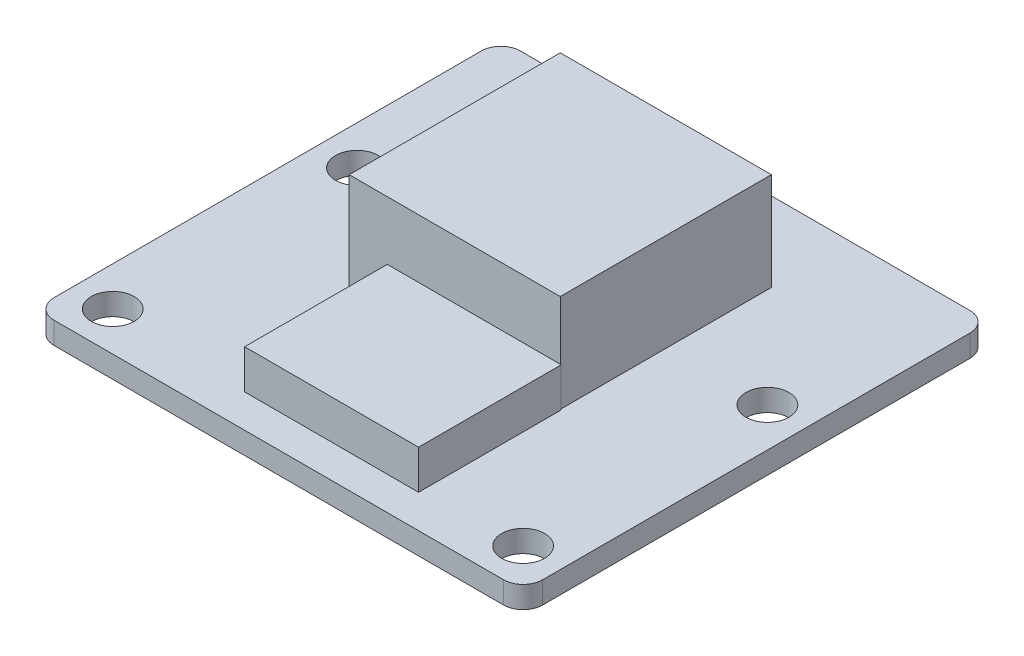
ISO-10303-21;
HEADER;
FILE_DESCRIPTION(('STEP AP214'),'2;1');
FILE_NAME('part.step','',(''),(''),'','','');
FILE_SCHEMA(('AUTOMOTIVE_DESIGN { 1 0 10303 214 1 1 1 1 }'));
ENDSEC;
DATA;
#1=APPLICATION_CONTEXT('core data for automotive mechanical design processes');
#2=APPLICATION_PROTOCOL_DEFINITION('international standard','automotive_design',2000,#1);
#3=PRODUCT_CONTEXT('',#1,'mechanical');
#4=PRODUCT('Part','Part','',(#3));
#5=PRODUCT_RELATED_PRODUCT_CATEGORY('part','',(#4));
#6=PRODUCT_DEFINITION_FORMATION('','',#4);
#7=PRODUCT_DEFINITION_CONTEXT('part definition',#1,'design');
#8=PRODUCT_DEFINITION('design','',#6,#7);
#9=PRODUCT_DEFINITION_SHAPE('','',#8);
#10=(LENGTH_UNIT() NAMED_UNIT(*) SI_UNIT(.MILLI.,.METRE.));
#11=(NAMED_UNIT(*) PLANE_ANGLE_UNIT() SI_UNIT($,.RADIAN.));
#12=(NAMED_UNIT(*) SI_UNIT($,.STERADIAN.) SOLID_ANGLE_UNIT());
#13=UNCERTAINTY_MEASURE_WITH_UNIT(LENGTH_MEASURE(1.E-05),#10,'distance_accuracy_value','');
#14=(GEOMETRIC_REPRESENTATION_CONTEXT(3) GLOBAL_UNCERTAINTY_ASSIGNED_CONTEXT((#13)) GLOBAL_UNIT_ASSIGNED_CONTEXT((#10,
#11,#12)) REPRESENTATION_CONTEXT('',''));
#15=CARTESIAN_POINT('',(0.,0.,0.));
#16=DIRECTION('',(0.,0.,1.));
#17=DIRECTION('',(1.,0.,0.));
#18=AXIS2_PLACEMENT_3D('',#15,#16,#17);
#19=CARTESIAN_POINT('',(0.,1.12,0.));
#20=DIRECTION('',(0.,-1.,0.));
#21=DIRECTION('',(0.,0.,-1.));
#22=AXIS2_PLACEMENT_3D('',#19,#20,#21);
#23=PLANE('',#22);
#24=CARTESIAN_POINT('',(10.5,1.12,-2.569));
#25=DIRECTION('',(0.,1.,0.));
#26=DIRECTION('',(0.,0.,1.));
#27=AXIS2_PLACEMENT_3D('',#24,#25,#26);
#28=CIRCLE('',#27,1.1);
#29=CARTESIAN_POINT('',(10.5,1.12,-1.469));
#30=VERTEX_POINT('',#29);
#31=EDGE_CURVE('E243',#30,#30,#28,.T.);
#32=ORIENTED_EDGE('',*,*,#31,.F.);
#33=EDGE_LOOP('',(#32));
#34=FACE_BOUND('',#33,.T.);
#35=CARTESIAN_POINT('',(-10.5,1.12,9.931));
#36=DIRECTION('',(0.,1.,0.));
#37=DIRECTION('',(0.,0.,1.));
#38=AXIS2_PLACEMENT_3D('',#35,#36,#37);
#39=CIRCLE('',#38,1.1);
#40=CARTESIAN_POINT('',(-10.5,1.12,11.031));
#41=VERTEX_POINT('',#40);
#42=EDGE_CURVE('E242',#41,#41,#39,.T.);
#43=ORIENTED_EDGE('',*,*,#42,.F.);
#44=EDGE_LOOP('',(#43));
#45=FACE_BOUND('',#44,.T.);
#46=CARTESIAN_POINT('',(10.5,1.12,9.931));
#47=DIRECTION('',(0.,1.,0.));
#48=DIRECTION('',(0.,0.,1.));
#49=AXIS2_PLACEMENT_3D('',#46,#47,#48);
#50=CIRCLE('',#49,1.1);
#51=CARTESIAN_POINT('',(10.5,1.12,11.031));
#52=VERTEX_POINT('',#51);
#53=EDGE_CURVE('E238',#52,#52,#50,.T.);
#54=ORIENTED_EDGE('',*,*,#53,.F.);
#55=EDGE_LOOP('',(#54));
#56=FACE_BOUND('',#55,.T.);
#57=CARTESIAN_POINT('',(-10.5,1.12,-2.569));
#58=DIRECTION('',(0.,1.,0.));
#59=DIRECTION('',(0.,0.,1.));
#60=AXIS2_PLACEMENT_3D('',#57,#58,#59);
#61=CIRCLE('',#60,1.1);
#62=CARTESIAN_POINT('',(-10.5,1.12,-1.469));
#63=VERTEX_POINT('',#62);
#64=EDGE_CURVE('E247',#63,#63,#61,.T.);
#65=ORIENTED_EDGE('',*,*,#64,.F.);
#66=EDGE_LOOP('',(#65));
#67=FACE_BOUND('',#66,.T.);
#68=DIRECTION('',(-1.,0.,0.));
#69=VECTOR('',#68,1.);
#70=CARTESIAN_POINT('',(12.5,1.12,-11.931));
#71=LINE('',#70,#69);
#72=CARTESIAN_POINT('',(11.5,1.12,-11.931));
#73=VERTEX_POINT('',#72);
#74=CARTESIAN_POINT('',(-11.5,1.12,-11.931));
#75=VERTEX_POINT('',#74);
#76=EDGE_CURVE('E268',#73,#75,#71,.T.);
#77=ORIENTED_EDGE('',*,*,#76,.T.);
#78=CARTESIAN_POINT('',(-11.5,1.12,-10.931));
#79=DIRECTION('',(0.,-1.,0.));
#80=DIRECTION('',(0.,0.,-1.));
#81=AXIS2_PLACEMENT_3D('',#78,#79,#80);
#82=CIRCLE('',#81,1.);
#83=CARTESIAN_POINT('',(-12.5,1.12,-10.931));
#84=VERTEX_POINT('',#83);
#85=EDGE_CURVE('E323',#75,#84,#82,.F.);
#86=ORIENTED_EDGE('',*,*,#85,.T.);
#87=DIRECTION('',(0.,0.,1.));
#88=VECTOR('',#87,1.);
#89=CARTESIAN_POINT('',(-12.5,1.12,-11.931));
#90=LINE('',#89,#88);
#91=CARTESIAN_POINT('',(-12.5,1.12,10.931));
#92=VERTEX_POINT('',#91);
#93=EDGE_CURVE('E255',#84,#92,#90,.T.);
#94=ORIENTED_EDGE('',*,*,#93,.T.);
#95=CARTESIAN_POINT('',(-11.5,1.12,10.931));
#96=DIRECTION('',(0.,-1.,0.));
#97=DIRECTION('',(0.,0.,-1.));
#98=AXIS2_PLACEMENT_3D('',#95,#96,#97);
#99=CIRCLE('',#98,1.);
#100=CARTESIAN_POINT('',(-11.5,1.12,11.931));
#101=VERTEX_POINT('',#100);
#102=EDGE_CURVE('E314',#92,#101,#99,.F.);
#103=ORIENTED_EDGE('',*,*,#102,.T.);
#104=DIRECTION('',(1.,0.,0.));
#105=VECTOR('',#104,1.);
#106=CARTESIAN_POINT('',(12.5,1.12,11.931));
#107=LINE('',#106,#105);
#108=CARTESIAN_POINT('',(11.5,1.12,11.931));
#109=VERTEX_POINT('',#108);
#110=EDGE_CURVE('E259',#101,#109,#107,.T.);
#111=ORIENTED_EDGE('',*,*,#110,.T.);
#112=CARTESIAN_POINT('',(11.5,1.12,10.931));
#113=DIRECTION('',(0.,-1.,0.));
#114=DIRECTION('',(0.,0.,-1.));
#115=AXIS2_PLACEMENT_3D('',#112,#113,#114);
#116=CIRCLE('',#115,1.);
#117=CARTESIAN_POINT('',(12.5,1.12,10.931));
#118=VERTEX_POINT('',#117);
#119=EDGE_CURVE('E317',#109,#118,#116,.F.);
#120=ORIENTED_EDGE('',*,*,#119,.T.);
#121=DIRECTION('',(0.,0.,-1.));
#122=VECTOR('',#121,1.);
#123=CARTESIAN_POINT('',(12.5,1.12,-11.931));
#124=LINE('',#123,#122);
#125=CARTESIAN_POINT('',(12.5,1.12,-10.931));
#126=VERTEX_POINT('',#125);
#127=EDGE_CURVE('E264',#118,#126,#124,.T.);
#128=ORIENTED_EDGE('',*,*,#127,.T.);
#129=CARTESIAN_POINT('',(11.5,1.12,-10.931));
#130=DIRECTION('',(0.,-1.,0.));
#131=DIRECTION('',(0.,0.,-1.));
#132=AXIS2_PLACEMENT_3D('',#129,#130,#131);
#133=CIRCLE('',#132,1.);
#134=EDGE_CURVE('E320',#126,#73,#133,.F.);
#135=ORIENTED_EDGE('',*,*,#134,.T.);
#136=EDGE_LOOP('',(#77,#86,#94,#103,#111,#120,#128,#135));
#137=FACE_BOUND('',#136,.T.);
#138=DIRECTION('',(-1.,0.,0.));
#139=VECTOR('',#138,1.);
#140=CARTESIAN_POINT('',(-3.45,1.12,2.931));
#141=LINE('',#140,#139);
#142=CARTESIAN_POINT('',(5.45,1.12,2.931));
#143=VERTEX_POINT('',#142);
#144=CARTESIAN_POINT('',(5.4,1.12,2.931));
#145=VERTEX_POINT('',#144);
#146=EDGE_CURVE('E61',#143,#145,#141,.T.);
#147=ORIENTED_EDGE('',*,*,#146,.F.);
#148=DIRECTION('',(0.,0.,-1.));
#149=VECTOR('',#148,1.);
#150=CARTESIAN_POINT('',(5.45,1.12,10.231));
#151=LINE('',#150,#149);
#152=CARTESIAN_POINT('',(5.45,1.12,10.231));
#153=VERTEX_POINT('',#152);
#154=EDGE_CURVE('E66',#153,#143,#151,.T.);
#155=ORIENTED_EDGE('',*,*,#154,.F.);
#156=DIRECTION('',(1.,0.,0.));
#157=VECTOR('',#156,1.);
#158=CARTESIAN_POINT('',(-3.45,1.12,10.231));
#159=LINE('',#158,#157);
#160=CARTESIAN_POINT('',(-3.45,1.12,10.231));
#161=VERTEX_POINT('',#160);
#162=EDGE_CURVE('E181',#161,#153,#159,.T.);
#163=ORIENTED_EDGE('',*,*,#162,.F.);
#164=DIRECTION('',(0.,0.,1.));
#165=VECTOR('',#164,1.);
#166=CARTESIAN_POINT('',(-3.45,1.12,10.231));
#167=LINE('',#166,#165);
#168=CARTESIAN_POINT('',(-3.45,1.12,2.931));
#169=VERTEX_POINT('',#168);
#170=EDGE_CURVE('E714',#169,#161,#167,.T.);
#171=ORIENTED_EDGE('',*,*,#170,.F.);
#172=DIRECTION('',(1.,0.,0.));
#173=VECTOR('',#172,1.);
#174=CARTESIAN_POINT('',(-5.4,1.12,2.931));
#175=LINE('',#174,#173);
#176=CARTESIAN_POINT('',(-5.4,1.12,2.931));
#177=VERTEX_POINT('',#176);
#178=EDGE_CURVE('E203',#177,#169,#175,.T.);
#179=ORIENTED_EDGE('',*,*,#178,.F.);
#180=DIRECTION('',(0.,0.,1.));
#181=VECTOR('',#180,1.);
#182=CARTESIAN_POINT('',(-5.4,1.12,2.931));
#183=LINE('',#182,#181);
#184=CARTESIAN_POINT('',(-5.4,1.12,-7.869));
#185=VERTEX_POINT('',#184);
#186=EDGE_CURVE('E215',#185,#177,#183,.T.);
#187=ORIENTED_EDGE('',*,*,#186,.F.);
#188=DIRECTION('',(-1.,0.,0.));
#189=VECTOR('',#188,1.);
#190=CARTESIAN_POINT('',(-5.4,1.12,-7.869));
#191=LINE('',#190,#189);
#192=CARTESIAN_POINT('',(5.4,1.12,-7.869));
#193=VERTEX_POINT('',#192);
#194=EDGE_CURVE('E191',#193,#185,#191,.T.);
#195=ORIENTED_EDGE('',*,*,#194,.F.);
#196=DIRECTION('',(0.,0.,-1.));
#197=VECTOR('',#196,1.);
#198=CARTESIAN_POINT('',(5.4,1.12,2.931));
#199=LINE('',#198,#197);
#200=EDGE_CURVE('E185',#145,#193,#199,.T.);
#201=ORIENTED_EDGE('',*,*,#200,.F.);
#202=EDGE_LOOP('',(#147,#155,#163,#171,#179,#187,#195,#201));
#203=FACE_BOUND('',#202,.T.);
#204=ADVANCED_FACE('F45',(#34,#45,#56,#67,#137,#203),#23,.F.);
#205=CARTESIAN_POINT('',(-5.4,6.12,2.931));
#206=DIRECTION('',(0.,0.,-1.));
#207=DIRECTION('',(-1.,0.,0.));
#208=AXIS2_PLACEMENT_3D('',#205,#206,#207);
#209=PLANE('',#208);
#210=DIRECTION('',(0.,-1.,0.));
#211=VECTOR('',#210,1.);
#212=CARTESIAN_POINT('',(-3.45,3.12,2.931));
#213=LINE('',#212,#211);
#214=CARTESIAN_POINT('',(-3.45,3.12,2.931));
#215=VERTEX_POINT('',#214);
#216=EDGE_CURVE('E186',#215,#169,#213,.T.);
#217=ORIENTED_EDGE('',*,*,#216,.F.);
#218=DIRECTION('',(-1.,0.,0.));
#219=VECTOR('',#218,1.);
#220=CARTESIAN_POINT('',(-5.4,3.12,2.931));
#221=LINE('',#220,#219);
#222=CARTESIAN_POINT('',(5.4,3.12,2.931));
#223=VERTEX_POINT('',#222);
#224=EDGE_CURVE('E11',#223,#215,#221,.T.);
#225=ORIENTED_EDGE('',*,*,#224,.F.);
#226=DIRECTION('',(0.,-1.,0.));
#227=VECTOR('',#226,1.);
#228=CARTESIAN_POINT('',(5.4,6.12,2.931));
#229=LINE('',#228,#227);
#230=CARTESIAN_POINT('',(5.4,6.12,2.931));
#231=VERTEX_POINT('',#230);
#232=EDGE_CURVE('E222',#231,#223,#229,.T.);
#233=ORIENTED_EDGE('',*,*,#232,.F.);
#234=DIRECTION('',(1.,0.,0.));
#235=VECTOR('',#234,1.);
#236=CARTESIAN_POINT('',(-5.4,6.12,2.931));
#237=LINE('',#236,#235);
#238=CARTESIAN_POINT('',(-5.4,6.12,2.931));
#239=VERTEX_POINT('',#238);
#240=EDGE_CURVE('E209',#239,#231,#237,.T.);
#241=ORIENTED_EDGE('',*,*,#240,.F.);
#242=DIRECTION('',(0.,-1.,0.));
#243=VECTOR('',#242,1.);
#244=CARTESIAN_POINT('',(-5.4,6.12,2.931));
#245=LINE('',#244,#243);
#246=EDGE_CURVE('E226',#239,#177,#245,.T.);
#247=ORIENTED_EDGE('',*,*,#246,.T.);
#248=ORIENTED_EDGE('',*,*,#178,.T.);
#249=EDGE_LOOP('',(#217,#225,#233,#241,#247,#248));
#250=FACE_BOUND('',#249,.T.);
#251=ADVANCED_FACE('F410',(#250),#209,.F.);
#252=CARTESIAN_POINT('',(-12.5,1.12,-11.931));
#253=DIRECTION('',(1.,0.,0.));
#254=DIRECTION('',(0.,0.,-1.));
#255=AXIS2_PLACEMENT_3D('',#252,#253,#254);
#256=PLANE('',#255);
#257=ORIENTED_EDGE('',*,*,#93,.F.);
#258=DIRECTION('',(0.,-1.,0.));
#259=VECTOR('',#258,1.);
#260=CARTESIAN_POINT('',(-12.5,1.12,-10.931));
#261=LINE('',#260,#259);
#262=CARTESIAN_POINT('',(-12.5,0.,-10.931));
#263=VERTEX_POINT('',#262);
#264=EDGE_CURVE('E291',#84,#263,#261,.T.);
#265=ORIENTED_EDGE('',*,*,#264,.T.);
#266=DIRECTION('',(0.,0.,1.));
#267=VECTOR('',#266,1.);
#268=CARTESIAN_POINT('',(-12.5,0.,-11.931));
#269=LINE('',#268,#267);
#270=CARTESIAN_POINT('',(-12.5,0.,10.931));
#271=VERTEX_POINT('',#270);
#272=EDGE_CURVE('E273',#263,#271,#269,.T.);
#273=ORIENTED_EDGE('',*,*,#272,.T.);
#274=DIRECTION('',(0.,-1.,0.));
#275=VECTOR('',#274,1.);
#276=CARTESIAN_POINT('',(-12.5,1.12,10.931));
#277=LINE('',#276,#275);
#278=EDGE_CURVE('E272',#271,#92,#277,.F.);
#279=ORIENTED_EDGE('',*,*,#278,.T.);
#280=EDGE_LOOP('',(#257,#265,#273,#279));
#281=FACE_BOUND('',#280,.T.);
#282=ADVANCED_FACE('F374',(#281),#256,.F.);
#283=CARTESIAN_POINT('',(12.5,1.12,11.931));
#284=DIRECTION('',(0.,0.,-1.));
#285=DIRECTION('',(-1.,0.,0.));
#286=AXIS2_PLACEMENT_3D('',#283,#284,#285);
#287=PLANE('',#286);
#288=DIRECTION('',(1.,0.,0.));
#289=VECTOR('',#288,1.);
#290=CARTESIAN_POINT('',(12.5,0.,11.931));
#291=LINE('',#290,#289);
#292=CARTESIAN_POINT('',(-11.5,0.,11.931));
#293=VERTEX_POINT('',#292);
#294=CARTESIAN_POINT('',(11.5,0.,11.931));
#295=VERTEX_POINT('',#294);
#296=EDGE_CURVE('E277',#293,#295,#291,.T.);
#297=ORIENTED_EDGE('',*,*,#296,.T.);
#298=DIRECTION('',(0.,-1.,0.));
#299=VECTOR('',#298,1.);
#300=CARTESIAN_POINT('',(11.5,1.12,11.931));
#301=LINE('',#300,#299);
#302=EDGE_CURVE('E54',#295,#109,#301,.F.);
#303=ORIENTED_EDGE('',*,*,#302,.T.);
#304=ORIENTED_EDGE('',*,*,#110,.F.);
#305=DIRECTION('',(0.,-1.,0.));
#306=VECTOR('',#305,1.);
#307=CARTESIAN_POINT('',(-11.5,1.12,11.931));
#308=LINE('',#307,#306);
#309=EDGE_CURVE('E333',#101,#293,#308,.T.);
#310=ORIENTED_EDGE('',*,*,#309,.T.);
#311=EDGE_LOOP('',(#297,#303,#304,#310));
#312=FACE_BOUND('',#311,.T.);
#313=ADVANCED_FACE('F383',(#312),#287,.F.);
#314=CARTESIAN_POINT('',(12.5,1.12,-11.931));
#315=DIRECTION('',(-1.,0.,0.));
#316=DIRECTION('',(0.,0.,1.));
#317=AXIS2_PLACEMENT_3D('',#314,#315,#316);
#318=PLANE('',#317);
#319=DIRECTION('',(0.,0.,-1.));
#320=VECTOR('',#319,1.);
#321=CARTESIAN_POINT('',(12.5,0.,-11.931));
#322=LINE('',#321,#320);
#323=CARTESIAN_POINT('',(12.5,0.,10.931));
#324=VERTEX_POINT('',#323);
#325=CARTESIAN_POINT('',(12.5,0.,-10.931));
#326=VERTEX_POINT('',#325);
#327=EDGE_CURVE('E282',#324,#326,#322,.T.);
#328=ORIENTED_EDGE('',*,*,#327,.T.);
#329=DIRECTION('',(0.,-1.,0.));
#330=VECTOR('',#329,1.);
#331=CARTESIAN_POINT('',(12.5,1.12,-10.931));
#332=LINE('',#331,#330);
#333=EDGE_CURVE('E330',#326,#126,#332,.F.);
#334=ORIENTED_EDGE('',*,*,#333,.T.);
#335=ORIENTED_EDGE('',*,*,#127,.F.);
#336=DIRECTION('',(0.,-1.,0.));
#337=VECTOR('',#336,1.);
#338=CARTESIAN_POINT('',(12.5,1.12,10.931));
#339=LINE('',#338,#337);
#340=EDGE_CURVE('E326',#118,#324,#339,.T.);
#341=ORIENTED_EDGE('',*,*,#340,.T.);
#342=EDGE_LOOP('',(#328,#334,#335,#341));
#343=FACE_BOUND('',#342,.T.);
#344=ADVANCED_FACE('F391',(#343),#318,.F.);
#345=CARTESIAN_POINT('',(12.5,1.12,-11.931));
#346=DIRECTION('',(0.,0.,1.));
#347=DIRECTION('',(1.,0.,0.));
#348=AXIS2_PLACEMENT_3D('',#345,#346,#347);
#349=PLANE('',#348);
#350=DIRECTION('',(-1.,0.,0.));
#351=VECTOR('',#350,1.);
#352=CARTESIAN_POINT('',(12.5,0.,-11.931));
#353=LINE('',#352,#351);
#354=CARTESIAN_POINT('',(11.5,0.,-11.931));
#355=VERTEX_POINT('',#354);
#356=CARTESIAN_POINT('',(-11.5,0.,-11.931));
#357=VERTEX_POINT('',#356);
#358=EDGE_CURVE('E260',#355,#357,#353,.T.);
#359=ORIENTED_EDGE('',*,*,#358,.T.);
#360=DIRECTION('',(0.,-1.,0.));
#361=VECTOR('',#360,1.);
#362=CARTESIAN_POINT('',(-11.5,1.12,-11.931));
#363=LINE('',#362,#361);
#364=EDGE_CURVE('E311',#357,#75,#363,.F.);
#365=ORIENTED_EDGE('',*,*,#364,.T.);
#366=ORIENTED_EDGE('',*,*,#76,.F.);
#367=DIRECTION('',(0.,-1.,0.));
#368=VECTOR('',#367,1.);
#369=CARTESIAN_POINT('',(11.5,1.12,-11.931));
#370=LINE('',#369,#368);
#371=EDGE_CURVE('E307',#73,#355,#370,.T.);
#372=ORIENTED_EDGE('',*,*,#371,.T.);
#373=EDGE_LOOP('',(#359,#365,#366,#372));
#374=FACE_BOUND('',#373,.T.);
#375=ADVANCED_FACE('F360',(#374),#349,.F.);
#376=CARTESIAN_POINT('',(0.,0.,0.));
#377=DIRECTION('',(0.,-1.,0.));
#378=DIRECTION('',(0.,0.,-1.));
#379=AXIS2_PLACEMENT_3D('',#376,#377,#378);
#380=PLANE('',#379);
#381=CARTESIAN_POINT('',(10.5,0.,-2.569));
#382=DIRECTION('',(0.,-1.,0.));
#383=DIRECTION('',(0.,0.,-1.));
#384=AXIS2_PLACEMENT_3D('',#381,#382,#383);
#385=CIRCLE('',#384,1.1);
#386=CARTESIAN_POINT('',(10.5,0.,-3.669));
#387=VERTEX_POINT('',#386);
#388=EDGE_CURVE('E278',#387,#387,#385,.T.);
#389=ORIENTED_EDGE('',*,*,#388,.F.);
#390=EDGE_LOOP('',(#389));
#391=FACE_BOUND('',#390,.T.);
#392=CARTESIAN_POINT('',(-10.5,0.,9.931));
#393=DIRECTION('',(0.,-1.,0.));
#394=DIRECTION('',(0.,0.,-1.));
#395=AXIS2_PLACEMENT_3D('',#392,#393,#394);
#396=CIRCLE('',#395,1.1);
#397=CARTESIAN_POINT('',(-10.5,0.,8.831));
#398=VERTEX_POINT('',#397);
#399=EDGE_CURVE('E346',#398,#398,#396,.T.);
#400=ORIENTED_EDGE('',*,*,#399,.F.);
#401=EDGE_LOOP('',(#400));
#402=FACE_BOUND('',#401,.T.);
#403=CARTESIAN_POINT('',(10.5,0.,9.931));
#404=DIRECTION('',(0.,-1.,0.));
#405=DIRECTION('',(0.,0.,-1.));
#406=AXIS2_PLACEMENT_3D('',#403,#404,#405);
#407=CIRCLE('',#406,1.1);
#408=CARTESIAN_POINT('',(10.5,0.,8.831));
#409=VERTEX_POINT('',#408);
#410=EDGE_CURVE('E342',#409,#409,#407,.T.);
#411=ORIENTED_EDGE('',*,*,#410,.F.);
#412=EDGE_LOOP('',(#411));
#413=FACE_BOUND('',#412,.T.);
#414=CARTESIAN_POINT('',(-10.5,0.,-2.569));
#415=DIRECTION('',(0.,-1.,0.));
#416=DIRECTION('',(0.,0.,-1.));
#417=AXIS2_PLACEMENT_3D('',#414,#415,#416);
#418=CIRCLE('',#417,1.1);
#419=CARTESIAN_POINT('',(-10.5,0.,-3.669));
#420=VERTEX_POINT('',#419);
#421=EDGE_CURVE('E254',#420,#420,#418,.T.);
#422=ORIENTED_EDGE('',*,*,#421,.F.);
#423=EDGE_LOOP('',(#422));
#424=FACE_BOUND('',#423,.T.);
#425=ORIENTED_EDGE('',*,*,#272,.F.);
#426=CARTESIAN_POINT('',(-11.5,0.,-10.931));
#427=DIRECTION('',(0.,-1.,0.));
#428=DIRECTION('',(0.,0.,-1.));
#429=AXIS2_PLACEMENT_3D('',#426,#427,#428);
#430=CIRCLE('',#429,1.);
#431=EDGE_CURVE('E304',#263,#357,#430,.T.);
#432=ORIENTED_EDGE('',*,*,#431,.T.);
#433=ORIENTED_EDGE('',*,*,#358,.F.);
#434=CARTESIAN_POINT('',(11.5,0.,-10.931));
#435=DIRECTION('',(0.,-1.,0.));
#436=DIRECTION('',(0.,0.,-1.));
#437=AXIS2_PLACEMENT_3D('',#434,#435,#436);
#438=CIRCLE('',#437,1.);
#439=EDGE_CURVE('E301',#355,#326,#438,.T.);
#440=ORIENTED_EDGE('',*,*,#439,.T.);
#441=ORIENTED_EDGE('',*,*,#327,.F.);
#442=CARTESIAN_POINT('',(11.5,0.,10.931));
#443=DIRECTION('',(0.,-1.,0.));
#444=DIRECTION('',(0.,0.,-1.));
#445=AXIS2_PLACEMENT_3D('',#442,#443,#444);
#446=CIRCLE('',#445,1.);
#447=EDGE_CURVE('E298',#324,#295,#446,.T.);
#448=ORIENTED_EDGE('',*,*,#447,.T.);
#449=ORIENTED_EDGE('',*,*,#296,.F.);
#450=CARTESIAN_POINT('',(-11.5,0.,10.931));
#451=DIRECTION('',(0.,-1.,0.));
#452=DIRECTION('',(0.,0.,-1.));
#453=AXIS2_PLACEMENT_3D('',#450,#451,#452);
#454=CIRCLE('',#453,1.);
#455=EDGE_CURVE('E295',#293,#271,#454,.T.);
#456=ORIENTED_EDGE('',*,*,#455,.T.);
#457=EDGE_LOOP('',(#425,#432,#433,#440,#441,#448,#449,#456));
#458=FACE_BOUND('',#457,.T.);
#459=ADVANCED_FACE('F356',(#391,#402,#413,#424,#458),#380,.T.);
#460=CARTESIAN_POINT('',(-11.5,1.12,-10.931));
#461=DIRECTION('',(0.,-1.,0.));
#462=DIRECTION('',(0.,0.,-1.));
#463=AXIS2_PLACEMENT_3D('',#460,#461,#462);
#464=CYLINDRICAL_SURFACE('',#463,1.);
#465=ORIENTED_EDGE('',*,*,#85,.F.);
#466=ORIENTED_EDGE('',*,*,#364,.F.);
#467=ORIENTED_EDGE('',*,*,#431,.F.);
#468=ORIENTED_EDGE('',*,*,#264,.F.);
#469=EDGE_LOOP('',(#465,#466,#467,#468));
#470=FACE_BOUND('',#469,.T.);
#471=ADVANCED_FACE('F359',(#470),#464,.T.);
#472=CARTESIAN_POINT('',(11.5,1.12,-10.931));
#473=DIRECTION('',(0.,-1.,0.));
#474=DIRECTION('',(0.,0.,-1.));
#475=AXIS2_PLACEMENT_3D('',#472,#473,#474);
#476=CYLINDRICAL_SURFACE('',#475,1.);
#477=ORIENTED_EDGE('',*,*,#134,.F.);
#478=ORIENTED_EDGE('',*,*,#333,.F.);
#479=ORIENTED_EDGE('',*,*,#439,.F.);
#480=ORIENTED_EDGE('',*,*,#371,.F.);
#481=EDGE_LOOP('',(#477,#478,#479,#480));
#482=FACE_BOUND('',#481,.T.);
#483=ADVANCED_FACE('F395',(#482),#476,.T.);
#484=CARTESIAN_POINT('',(11.5,1.12,10.931));
#485=DIRECTION('',(0.,-1.,0.));
#486=DIRECTION('',(0.,0.,-1.));
#487=AXIS2_PLACEMENT_3D('',#484,#485,#486);
#488=CYLINDRICAL_SURFACE('',#487,1.);
#489=ORIENTED_EDGE('',*,*,#119,.F.);
#490=ORIENTED_EDGE('',*,*,#302,.F.);
#491=ORIENTED_EDGE('',*,*,#447,.F.);
#492=ORIENTED_EDGE('',*,*,#340,.F.);
#493=EDGE_LOOP('',(#489,#490,#491,#492));
#494=FACE_BOUND('',#493,.T.);
#495=ADVANCED_FACE('F386',(#494),#488,.T.);
#496=CARTESIAN_POINT('',(-11.5,1.12,10.931));
#497=DIRECTION('',(0.,-1.,0.));
#498=DIRECTION('',(0.,0.,-1.));
#499=AXIS2_PLACEMENT_3D('',#496,#497,#498);
#500=CYLINDRICAL_SURFACE('',#499,1.);
#501=ORIENTED_EDGE('',*,*,#102,.F.);
#502=ORIENTED_EDGE('',*,*,#278,.F.);
#503=ORIENTED_EDGE('',*,*,#455,.F.);
#504=ORIENTED_EDGE('',*,*,#309,.F.);
#505=EDGE_LOOP('',(#501,#502,#503,#504));
#506=FACE_BOUND('',#505,.T.);
#507=ADVANCED_FACE('F47',(#506),#500,.T.);
#508=CARTESIAN_POINT('',(-10.5,-0.88,-2.569));
#509=DIRECTION('',(0.,1.,0.));
#510=DIRECTION('',(0.,0.,1.));
#511=AXIS2_PLACEMENT_3D('',#508,#509,#510);
#512=CYLINDRICAL_SURFACE('',#511,1.1);
#513=ORIENTED_EDGE('',*,*,#421,.T.);
#514=EDGE_LOOP('',(#513));
#515=FACE_BOUND('',#514,.T.);
#516=ORIENTED_EDGE('',*,*,#64,.T.);
#517=EDGE_LOOP('',(#516));
#518=FACE_BOUND('',#517,.T.);
#519=ADVANCED_FACE('F421',(#515,#518),#512,.F.);
#520=CARTESIAN_POINT('',(10.5,-0.88,9.931));
#521=DIRECTION('',(0.,1.,0.));
#522=DIRECTION('',(0.,0.,1.));
#523=AXIS2_PLACEMENT_3D('',#520,#521,#522);
#524=CYLINDRICAL_SURFACE('',#523,1.1);
#525=ORIENTED_EDGE('',*,*,#410,.T.);
#526=EDGE_LOOP('',(#525));
#527=FACE_BOUND('',#526,.T.);
#528=ORIENTED_EDGE('',*,*,#53,.T.);
#529=EDGE_LOOP('',(#528));
#530=FACE_BOUND('',#529,.T.);
#531=ADVANCED_FACE('F483',(#527,#530),#524,.F.);
#532=CARTESIAN_POINT('',(-10.5,-0.88,9.931));
#533=DIRECTION('',(0.,1.,0.));
#534=DIRECTION('',(0.,0.,1.));
#535=AXIS2_PLACEMENT_3D('',#532,#533,#534);
#536=CYLINDRICAL_SURFACE('',#535,1.1);
#537=ORIENTED_EDGE('',*,*,#399,.T.);
#538=EDGE_LOOP('',(#537));
#539=FACE_BOUND('',#538,.T.);
#540=ORIENTED_EDGE('',*,*,#42,.T.);
#541=EDGE_LOOP('',(#540));
#542=FACE_BOUND('',#541,.T.);
#543=ADVANCED_FACE('F492',(#539,#542),#536,.F.);
#544=CARTESIAN_POINT('',(10.5,-0.88,-2.569));
#545=DIRECTION('',(0.,1.,0.));
#546=DIRECTION('',(0.,0.,1.));
#547=AXIS2_PLACEMENT_3D('',#544,#545,#546);
#548=CYLINDRICAL_SURFACE('',#547,1.1);
#549=ORIENTED_EDGE('',*,*,#388,.T.);
#550=EDGE_LOOP('',(#549));
#551=FACE_BOUND('',#550,.T.);
#552=ORIENTED_EDGE('',*,*,#31,.T.);
#553=EDGE_LOOP('',(#552));
#554=FACE_BOUND('',#553,.T.);
#555=ADVANCED_FACE('F353',(#551,#554),#548,.F.);
#556=CARTESIAN_POINT('',(5.4,6.12,2.931));
#557=DIRECTION('',(-1.,0.,0.));
#558=DIRECTION('',(0.,0.,1.));
#559=AXIS2_PLACEMENT_3D('',#556,#557,#558);
#560=PLANE('',#559);
#561=ORIENTED_EDGE('',*,*,#200,.T.);
#562=DIRECTION('',(0.,-1.,0.));
#563=VECTOR('',#562,1.);
#564=CARTESIAN_POINT('',(5.4,6.12,-7.869));
#565=LINE('',#564,#563);
#566=CARTESIAN_POINT('',(5.4,6.12,-7.869));
#567=VERTEX_POINT('',#566);
#568=EDGE_CURVE('E234',#567,#193,#565,.T.);
#569=ORIENTED_EDGE('',*,*,#568,.F.);
#570=DIRECTION('',(0.,0.,-1.));
#571=VECTOR('',#570,1.);
#572=CARTESIAN_POINT('',(5.4,6.12,2.931));
#573=LINE('',#572,#571);
#574=EDGE_CURVE('E198',#231,#567,#573,.T.);
#575=ORIENTED_EDGE('',*,*,#574,.F.);
#576=ORIENTED_EDGE('',*,*,#232,.T.);
#577=EDGE_CURVE('E167',#223,#145,#229,.T.);
#578=ORIENTED_EDGE('',*,*,#577,.T.);
#579=EDGE_LOOP('',(#561,#569,#575,#576,#578));
#580=FACE_BOUND('',#579,.T.);
#581=ADVANCED_FACE('F510',(#580),#560,.F.);
#582=CARTESIAN_POINT('',(-5.4,6.12,-7.869));
#583=DIRECTION('',(0.,0.,1.));
#584=DIRECTION('',(1.,0.,0.));
#585=AXIS2_PLACEMENT_3D('',#582,#583,#584);
#586=PLANE('',#585);
#587=ORIENTED_EDGE('',*,*,#194,.T.);
#588=DIRECTION('',(0.,-1.,0.));
#589=VECTOR('',#588,1.);
#590=CARTESIAN_POINT('',(-5.4,6.12,-7.869));
#591=LINE('',#590,#589);
#592=CARTESIAN_POINT('',(-5.4,6.12,-7.869));
#593=VERTEX_POINT('',#592);
#594=EDGE_CURVE('E230',#593,#185,#591,.T.);
#595=ORIENTED_EDGE('',*,*,#594,.F.);
#596=DIRECTION('',(-1.,0.,0.));
#597=VECTOR('',#596,1.);
#598=CARTESIAN_POINT('',(-5.4,6.12,-7.869));
#599=LINE('',#598,#597);
#600=EDGE_CURVE('E202',#567,#593,#599,.T.);
#601=ORIENTED_EDGE('',*,*,#600,.F.);
#602=ORIENTED_EDGE('',*,*,#568,.T.);
#603=EDGE_LOOP('',(#587,#595,#601,#602));
#604=FACE_BOUND('',#603,.T.);
#605=ADVANCED_FACE('F520',(#604),#586,.F.);
#606=CARTESIAN_POINT('',(-5.4,6.12,2.931));
#607=DIRECTION('',(1.,0.,0.));
#608=DIRECTION('',(0.,0.,-1.));
#609=AXIS2_PLACEMENT_3D('',#606,#607,#608);
#610=PLANE('',#609);
#611=ORIENTED_EDGE('',*,*,#186,.T.);
#612=ORIENTED_EDGE('',*,*,#246,.F.);
#613=DIRECTION('',(0.,0.,1.));
#614=VECTOR('',#613,1.);
#615=CARTESIAN_POINT('',(-5.4,6.12,2.931));
#616=LINE('',#615,#614);
#617=EDGE_CURVE('E206',#593,#239,#616,.T.);
#618=ORIENTED_EDGE('',*,*,#617,.F.);
#619=ORIENTED_EDGE('',*,*,#594,.T.);
#620=EDGE_LOOP('',(#611,#612,#618,#619));
#621=FACE_BOUND('',#620,.T.);
#622=ADVANCED_FACE('F531',(#621),#610,.F.);
#623=CARTESIAN_POINT('',(0.,6.12,0.));
#624=DIRECTION('',(0.,-1.,0.));
#625=DIRECTION('',(0.,0.,-1.));
#626=AXIS2_PLACEMENT_3D('',#623,#624,#625);
#627=PLANE('',#626);
#628=ORIENTED_EDGE('',*,*,#574,.T.);
#629=ORIENTED_EDGE('',*,*,#600,.T.);
#630=ORIENTED_EDGE('',*,*,#617,.T.);
#631=ORIENTED_EDGE('',*,*,#240,.T.);
#632=EDGE_LOOP('',(#628,#629,#630,#631));
#633=FACE_BOUND('',#632,.T.);
#634=ADVANCED_FACE('F541',(#633),#627,.F.);
#635=CARTESIAN_POINT('',(-3.45,3.12,2.931));
#636=DIRECTION('',(0.,0.,1.));
#637=DIRECTION('',(1.,0.,0.));
#638=AXIS2_PLACEMENT_3D('',#635,#636,#637);
#639=PLANE('',#638);
#640=ORIENTED_EDGE('',*,*,#146,.T.);
#641=ORIENTED_EDGE('',*,*,#577,.F.);
#642=DIRECTION('',(-1.,0.,0.));
#643=VECTOR('',#642,1.);
#644=CARTESIAN_POINT('',(-3.45,3.12,2.931));
#645=LINE('',#644,#643);
#646=CARTESIAN_POINT('',(5.45,3.12,2.931));
#647=VERTEX_POINT('',#646);
#648=EDGE_CURVE('E162',#647,#223,#645,.T.);
#649=ORIENTED_EDGE('',*,*,#648,.F.);
#650=DIRECTION('',(0.,-1.,0.));
#651=VECTOR('',#650,1.);
#652=CARTESIAN_POINT('',(5.45,3.12,2.931));
#653=LINE('',#652,#651);
#654=EDGE_CURVE('E166',#647,#143,#653,.T.);
#655=ORIENTED_EDGE('',*,*,#654,.T.);
#656=EDGE_LOOP('',(#640,#641,#649,#655));
#657=FACE_BOUND('',#656,.T.);
#658=ADVANCED_FACE('F164',(#657),#639,.F.);
#659=CARTESIAN_POINT('',(5.45,3.12,10.231));
#660=DIRECTION('',(-1.,0.,0.));
#661=DIRECTION('',(0.,0.,1.));
#662=AXIS2_PLACEMENT_3D('',#659,#660,#661);
#663=PLANE('',#662);
#664=ORIENTED_EDGE('',*,*,#154,.T.);
#665=ORIENTED_EDGE('',*,*,#654,.F.);
#666=DIRECTION('',(0.,0.,-1.));
#667=VECTOR('',#666,1.);
#668=CARTESIAN_POINT('',(5.45,3.12,10.231));
#669=LINE('',#668,#667);
#670=CARTESIAN_POINT('',(5.45,3.12,10.231));
#671=VERTEX_POINT('',#670);
#672=EDGE_CURVE('E171',#671,#647,#669,.T.);
#673=ORIENTED_EDGE('',*,*,#672,.F.);
#674=DIRECTION('',(0.,-1.,0.));
#675=VECTOR('',#674,1.);
#676=CARTESIAN_POINT('',(5.45,3.12,10.231));
#677=LINE('',#676,#675);
#678=EDGE_CURVE('E710',#671,#153,#677,.T.);
#679=ORIENTED_EDGE('',*,*,#678,.T.);
#680=EDGE_LOOP('',(#664,#665,#673,#679));
#681=FACE_BOUND('',#680,.T.);
#682=ADVANCED_FACE('F183',(#681),#663,.F.);
#683=CARTESIAN_POINT('',(-3.45,3.12,10.231));
#684=DIRECTION('',(1.,0.,0.));
#685=DIRECTION('',(0.,0.,-1.));
#686=AXIS2_PLACEMENT_3D('',#683,#684,#685);
#687=PLANE('',#686);
#688=ORIENTED_EDGE('',*,*,#170,.T.);
#689=DIRECTION('',(0.,-1.,0.));
#690=VECTOR('',#689,1.);
#691=CARTESIAN_POINT('',(-3.45,3.12,10.231));
#692=LINE('',#691,#690);
#693=CARTESIAN_POINT('',(-3.45,3.12,10.231));
#694=VERTEX_POINT('',#693);
#695=EDGE_CURVE('E194',#694,#161,#692,.T.);
#696=ORIENTED_EDGE('',*,*,#695,.F.);
#697=DIRECTION('',(0.,0.,1.));
#698=VECTOR('',#697,1.);
#699=CARTESIAN_POINT('',(-3.45,3.12,10.231));
#700=LINE('',#699,#698);
#701=EDGE_CURVE('E170',#215,#694,#700,.T.);
#702=ORIENTED_EDGE('',*,*,#701,.F.);
#703=ORIENTED_EDGE('',*,*,#216,.T.);
#704=EDGE_LOOP('',(#688,#696,#702,#703));
#705=FACE_BOUND('',#704,.T.);
#706=ADVANCED_FACE('F568',(#705),#687,.F.);
#707=CARTESIAN_POINT('',(-3.45,3.12,10.231));
#708=DIRECTION('',(0.,0.,-1.));
#709=DIRECTION('',(-1.,0.,0.));
#710=AXIS2_PLACEMENT_3D('',#707,#708,#709);
#711=PLANE('',#710);
#712=ORIENTED_EDGE('',*,*,#162,.T.);
#713=ORIENTED_EDGE('',*,*,#678,.F.);
#714=DIRECTION('',(1.,0.,0.));
#715=VECTOR('',#714,1.);
#716=CARTESIAN_POINT('',(-3.45,3.12,10.231));
#717=LINE('',#716,#715);
#718=EDGE_CURVE('E176',#694,#671,#717,.T.);
#719=ORIENTED_EDGE('',*,*,#718,.F.);
#720=ORIENTED_EDGE('',*,*,#695,.T.);
#721=EDGE_LOOP('',(#712,#713,#719,#720));
#722=FACE_BOUND('',#721,.T.);
#723=ADVANCED_FACE('F577',(#722),#711,.F.);
#724=CARTESIAN_POINT('',(0.,3.12,0.));
#725=DIRECTION('',(0.,-1.,0.));
#726=DIRECTION('',(0.,0.,-1.));
#727=AXIS2_PLACEMENT_3D('',#724,#725,#726);
#728=PLANE('',#727);
#729=ORIENTED_EDGE('',*,*,#672,.T.);
#730=ORIENTED_EDGE('',*,*,#648,.T.);
#731=ORIENTED_EDGE('',*,*,#224,.T.);
#732=ORIENTED_EDGE('',*,*,#701,.T.);
#733=ORIENTED_EDGE('',*,*,#718,.T.);
#734=EDGE_LOOP('',(#729,#730,#731,#732,#733));
#735=FACE_BOUND('',#734,.T.);
#736=ADVANCED_FACE('F174',(#735),#728,.F.);
#737=CLOSED_SHELL('',(#204,#251,#282,#313,#344,#375,#459,#471,#483,#495,#507,#519,#531,#543,
#555,#581,#605,#622,#634,#658,#682,#706,#723,#736));
#738=MANIFOLD_SOLID_BREP('B2',#737);
#739=ADVANCED_BREP_SHAPE_REPRESENTATION('',(#18,#738),#14);
#740=SHAPE_DEFINITION_REPRESENTATION(#9,#739);
ENDSEC;
END-ISO-10303-21;
